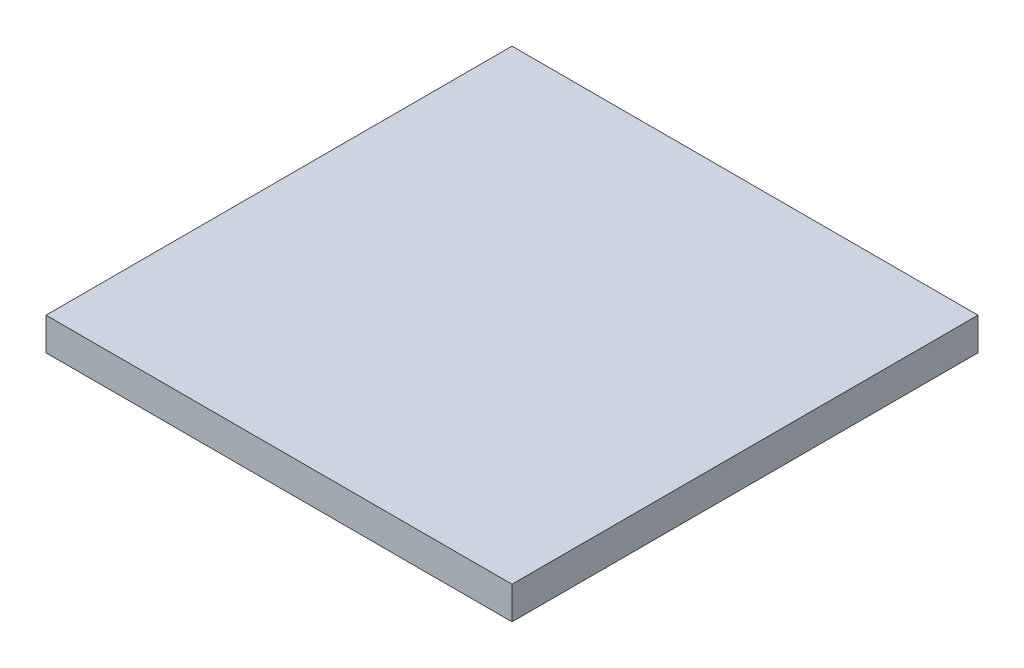
ISO-10303-21;
HEADER;
FILE_DESCRIPTION(('STEP AP214'),'2;1');
FILE_NAME('part.step','',(''),(''),'','','');
FILE_SCHEMA(('AUTOMOTIVE_DESIGN { 1 0 10303 214 1 1 1 1 }'));
ENDSEC;
DATA;
#1=APPLICATION_CONTEXT('core data for automotive mechanical design processes');
#2=APPLICATION_PROTOCOL_DEFINITION('international standard','automotive_design',2000,#1);
#3=PRODUCT_CONTEXT('',#1,'mechanical');
#4=PRODUCT('Part','Part','',(#3));
#5=PRODUCT_RELATED_PRODUCT_CATEGORY('part','',(#4));
#6=PRODUCT_DEFINITION_FORMATION('','',#4);
#7=PRODUCT_DEFINITION_CONTEXT('part definition',#1,'design');
#8=PRODUCT_DEFINITION('design','',#6,#7);
#9=PRODUCT_DEFINITION_SHAPE('','',#8);
#10=(LENGTH_UNIT() NAMED_UNIT(*) SI_UNIT(.MILLI.,.METRE.));
#11=(NAMED_UNIT(*) PLANE_ANGLE_UNIT() SI_UNIT($,.RADIAN.));
#12=(NAMED_UNIT(*) SI_UNIT($,.STERADIAN.) SOLID_ANGLE_UNIT());
#13=UNCERTAINTY_MEASURE_WITH_UNIT(LENGTH_MEASURE(1.E-05),#10,'distance_accuracy_value','');
#14=(GEOMETRIC_REPRESENTATION_CONTEXT(3) GLOBAL_UNCERTAINTY_ASSIGNED_CONTEXT((#13)) GLOBAL_UNIT_ASSIGNED_CONTEXT((#10,
#11,#12)) REPRESENTATION_CONTEXT('',''));
#15=CARTESIAN_POINT('',(0.,0.,0.));
#16=DIRECTION('',(0.,0.,1.));
#17=DIRECTION('',(1.,0.,0.));
#18=AXIS2_PLACEMENT_3D('',#15,#16,#17);
#19=CARTESIAN_POINT('',(250.,-35.,250.));
#20=DIRECTION('',(1.,0.,0.));
#21=DIRECTION('',(0.,0.,-1.));
#22=AXIS2_PLACEMENT_3D('',#19,#20,#21);
#23=PLANE('',#22);
#24=DIRECTION('',(0.,0.,-1.));
#25=VECTOR('',#24,1.);
#26=CARTESIAN_POINT('',(250.,0.,250.));
#27=LINE('',#26,#25);
#28=CARTESIAN_POINT('',(250.,0.,250.));
#29=VERTEX_POINT('',#28);
#30=CARTESIAN_POINT('',(250.,0.,-250.));
#31=VERTEX_POINT('',#30);
#32=EDGE_CURVE('E96',#29,#31,#27,.T.);
#33=ORIENTED_EDGE('',*,*,#32,.F.);
#34=DIRECTION('',(0.,1.,0.));
#35=VECTOR('',#34,1.);
#36=CARTESIAN_POINT('',(250.,-35.,250.));
#37=LINE('',#36,#35);
#38=CARTESIAN_POINT('',(250.,-35.,250.));
#39=VERTEX_POINT('',#38);
#40=EDGE_CURVE('E11',#39,#29,#37,.T.);
#41=ORIENTED_EDGE('',*,*,#40,.F.);
#42=DIRECTION('',(0.,0.,-1.));
#43=VECTOR('',#42,1.);
#44=CARTESIAN_POINT('',(250.,-35.,250.));
#45=LINE('',#44,#43);
#46=CARTESIAN_POINT('',(250.,-35.,-250.));
#47=VERTEX_POINT('',#46);
#48=EDGE_CURVE('E90',#39,#47,#45,.T.);
#49=ORIENTED_EDGE('',*,*,#48,.T.);
#50=DIRECTION('',(0.,1.,0.));
#51=VECTOR('',#50,1.);
#52=CARTESIAN_POINT('',(250.,-35.,-250.));
#53=LINE('',#52,#51);
#54=EDGE_CURVE('E35',#47,#31,#53,.T.);
#55=ORIENTED_EDGE('',*,*,#54,.T.);
#56=EDGE_LOOP('',(#33,#41,#49,#55));
#57=FACE_BOUND('',#56,.T.);
#58=ADVANCED_FACE('F32',(#57),#23,.T.);
#59=CARTESIAN_POINT('',(-250.,-35.,250.));
#60=DIRECTION('',(0.,0.,1.));
#61=DIRECTION('',(1.,0.,0.));
#62=AXIS2_PLACEMENT_3D('',#59,#60,#61);
#63=PLANE('',#62);
#64=DIRECTION('',(1.,0.,0.));
#65=VECTOR('',#64,1.);
#66=CARTESIAN_POINT('',(-250.,0.,250.));
#67=LINE('',#66,#65);
#68=CARTESIAN_POINT('',(-250.,0.,250.));
#69=VERTEX_POINT('',#68);
#70=EDGE_CURVE('E92',#69,#29,#67,.T.);
#71=ORIENTED_EDGE('',*,*,#70,.F.);
#72=DIRECTION('',(0.,1.,0.));
#73=VECTOR('',#72,1.);
#74=CARTESIAN_POINT('',(-250.,-35.,250.));
#75=LINE('',#74,#73);
#76=CARTESIAN_POINT('',(-250.,-35.,250.));
#77=VERTEX_POINT('',#76);
#78=EDGE_CURVE('E41',#77,#69,#75,.T.);
#79=ORIENTED_EDGE('',*,*,#78,.F.);
#80=DIRECTION('',(1.,0.,0.));
#81=VECTOR('',#80,1.);
#82=CARTESIAN_POINT('',(-250.,-35.,250.));
#83=LINE('',#82,#81);
#84=EDGE_CURVE('E87',#77,#39,#83,.T.);
#85=ORIENTED_EDGE('',*,*,#84,.T.);
#86=ORIENTED_EDGE('',*,*,#40,.T.);
#87=EDGE_LOOP('',(#71,#79,#85,#86));
#88=FACE_BOUND('',#87,.T.);
#89=ADVANCED_FACE('F106',(#88),#63,.T.);
#90=CARTESIAN_POINT('',(-250.,-35.,250.));
#91=DIRECTION('',(-1.,0.,0.));
#92=DIRECTION('',(0.,0.,1.));
#93=AXIS2_PLACEMENT_3D('',#90,#91,#92);
#94=PLANE('',#93);
#95=DIRECTION('',(0.,0.,1.));
#96=VECTOR('',#95,1.);
#97=CARTESIAN_POINT('',(-250.,0.,250.));
#98=LINE('',#97,#96);
#99=CARTESIAN_POINT('',(-250.,0.,-250.));
#100=VERTEX_POINT('',#99);
#101=EDGE_CURVE('E82',#100,#69,#98,.T.);
#102=ORIENTED_EDGE('',*,*,#101,.F.);
#103=DIRECTION('',(0.,1.,0.));
#104=VECTOR('',#103,1.);
#105=CARTESIAN_POINT('',(-250.,-35.,-250.));
#106=LINE('',#105,#104);
#107=CARTESIAN_POINT('',(-250.,-35.,-250.));
#108=VERTEX_POINT('',#107);
#109=EDGE_CURVE('E77',#108,#100,#106,.T.);
#110=ORIENTED_EDGE('',*,*,#109,.F.);
#111=DIRECTION('',(0.,0.,1.));
#112=VECTOR('',#111,1.);
#113=CARTESIAN_POINT('',(-250.,-35.,250.));
#114=LINE('',#113,#112);
#115=EDGE_CURVE('E80',#108,#77,#114,.T.);
#116=ORIENTED_EDGE('',*,*,#115,.T.);
#117=ORIENTED_EDGE('',*,*,#78,.T.);
#118=EDGE_LOOP('',(#102,#110,#116,#117));
#119=FACE_BOUND('',#118,.T.);
#120=ADVANCED_FACE('F79',(#119),#94,.T.);
#121=CARTESIAN_POINT('',(-250.,-35.,-250.));
#122=DIRECTION('',(0.,0.,-1.));
#123=DIRECTION('',(-1.,0.,0.));
#124=AXIS2_PLACEMENT_3D('',#121,#122,#123);
#125=PLANE('',#124);
#126=DIRECTION('',(-1.,0.,0.));
#127=VECTOR('',#126,1.);
#128=CARTESIAN_POINT('',(-250.,0.,-250.));
#129=LINE('',#128,#127);
#130=EDGE_CURVE('E99',#31,#100,#129,.T.);
#131=ORIENTED_EDGE('',*,*,#130,.F.);
#132=ORIENTED_EDGE('',*,*,#54,.F.);
#133=DIRECTION('',(-1.,0.,0.));
#134=VECTOR('',#133,1.);
#135=CARTESIAN_POINT('',(-250.,-35.,-250.));
#136=LINE('',#135,#134);
#137=EDGE_CURVE('E86',#47,#108,#136,.T.);
#138=ORIENTED_EDGE('',*,*,#137,.T.);
#139=ORIENTED_EDGE('',*,*,#109,.T.);
#140=EDGE_LOOP('',(#131,#132,#138,#139));
#141=FACE_BOUND('',#140,.T.);
#142=ADVANCED_FACE('F89',(#141),#125,.T.);
#143=CARTESIAN_POINT('',(0.,-35.,0.));
#144=DIRECTION('',(0.,-1.,0.));
#145=DIRECTION('',(0.,0.,-1.));
#146=AXIS2_PLACEMENT_3D('',#143,#144,#145);
#147=PLANE('',#146);
#148=ORIENTED_EDGE('',*,*,#48,.F.);
#149=ORIENTED_EDGE('',*,*,#84,.F.);
#150=ORIENTED_EDGE('',*,*,#115,.F.);
#151=ORIENTED_EDGE('',*,*,#137,.F.);
#152=EDGE_LOOP('',(#148,#149,#150,#151));
#153=FACE_BOUND('',#152,.T.);
#154=ADVANCED_FACE('F85',(#153),#147,.T.);
#155=CARTESIAN_POINT('',(0.,0.,0.));
#156=DIRECTION('',(0.,-1.,0.));
#157=DIRECTION('',(0.,0.,-1.));
#158=AXIS2_PLACEMENT_3D('',#155,#156,#157);
#159=PLANE('',#158);
#160=ORIENTED_EDGE('',*,*,#32,.T.);
#161=ORIENTED_EDGE('',*,*,#130,.T.);
#162=ORIENTED_EDGE('',*,*,#101,.T.);
#163=ORIENTED_EDGE('',*,*,#70,.T.);
#164=EDGE_LOOP('',(#160,#161,#162,#163));
#165=FACE_BOUND('',#164,.T.);
#166=ADVANCED_FACE('F105',(#165),#159,.F.);
#167=CLOSED_SHELL('',(#58,#89,#120,#142,#154,#166));
#168=MANIFOLD_SOLID_BREP('B2',#167);
#169=ADVANCED_BREP_SHAPE_REPRESENTATION('',(#18,#168),#14);
#170=SHAPE_DEFINITION_REPRESENTATION(#9,#169);
ENDSEC;
END-ISO-10303-21;
